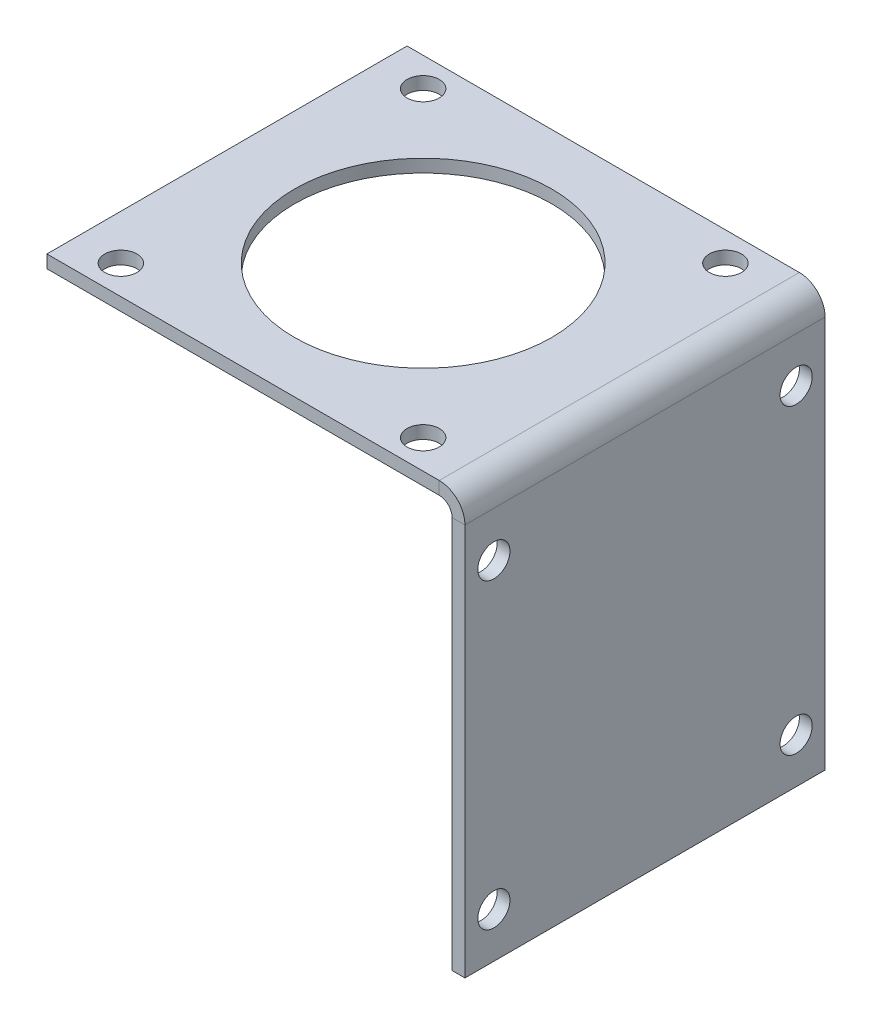
ISO-10303-21;
HEADER;
FILE_DESCRIPTION(('STEP AP214'),'2;1');
FILE_NAME('part.step','',(''),(''),'','','');
FILE_SCHEMA(('AUTOMOTIVE_DESIGN { 1 0 10303 214 1 1 1 1 }'));
ENDSEC;
DATA;
#1=APPLICATION_CONTEXT('core data for automotive mechanical design processes');
#2=APPLICATION_PROTOCOL_DEFINITION('international standard','automotive_design',2000,#1);
#3=PRODUCT_CONTEXT('',#1,'mechanical');
#4=PRODUCT('Part','Part','',(#3));
#5=PRODUCT_RELATED_PRODUCT_CATEGORY('part','',(#4));
#6=PRODUCT_DEFINITION_FORMATION('','',#4);
#7=PRODUCT_DEFINITION_CONTEXT('part definition',#1,'design');
#8=PRODUCT_DEFINITION('design','',#6,#7);
#9=PRODUCT_DEFINITION_SHAPE('','',#8);
#10=(LENGTH_UNIT() NAMED_UNIT(*) SI_UNIT(.MILLI.,.METRE.));
#11=(NAMED_UNIT(*) PLANE_ANGLE_UNIT() SI_UNIT($,.RADIAN.));
#12=(NAMED_UNIT(*) SI_UNIT($,.STERADIAN.) SOLID_ANGLE_UNIT());
#13=UNCERTAINTY_MEASURE_WITH_UNIT(LENGTH_MEASURE(1.E-05),#10,'distance_accuracy_value','');
#14=(GEOMETRIC_REPRESENTATION_CONTEXT(3) GLOBAL_UNCERTAINTY_ASSIGNED_CONTEXT((#13)) GLOBAL_UNIT_ASSIGNED_CONTEXT((#10,
#11,#12)) REPRESENTATION_CONTEXT('',''));
#15=CARTESIAN_POINT('',(0.,0.,0.));
#16=DIRECTION('',(0.,0.,1.));
#17=DIRECTION('',(1.,0.,0.));
#18=AXIS2_PLACEMENT_3D('',#15,#16,#17);
#19=CARTESIAN_POINT('',(0.,-4.,56.));
#20=DIRECTION('',(0.,0.,1.));
#21=DIRECTION('',(1.,0.,0.));
#22=AXIS2_PLACEMENT_3D('',#19,#20,#21);
#23=PLANE('',#22);
#24=DIRECTION('',(-1.,0.,0.));
#25=VECTOR('',#24,1.);
#26=CARTESIAN_POINT('',(0.,-4.,56.));
#27=LINE('',#26,#25);
#28=CARTESIAN_POINT('',(0.,-4.,56.));
#29=VERTEX_POINT('',#28);
#30=CARTESIAN_POINT('',(-2.,-4.,56.));
#31=VERTEX_POINT('',#30);
#32=EDGE_CURVE('E11',#29,#31,#27,.T.);
#33=ORIENTED_EDGE('',*,*,#32,.F.);
#34=CARTESIAN_POINT('',(-4.,-4.,56.));
#35=DIRECTION('',(0.,0.,1.));
#36=DIRECTION('',(1.,0.,0.));
#37=AXIS2_PLACEMENT_3D('',#34,#35,#36);
#38=CIRCLE('',#37,4.);
#39=CARTESIAN_POINT('',(-4.,0.,56.));
#40=VERTEX_POINT('',#39);
#41=EDGE_CURVE('E132',#40,#29,#38,.F.);
#42=ORIENTED_EDGE('',*,*,#41,.F.);
#43=DIRECTION('',(0.,1.,0.));
#44=VECTOR('',#43,1.);
#45=CARTESIAN_POINT('',(-4.,-2.,56.));
#46=LINE('',#45,#44);
#47=CARTESIAN_POINT('',(-4.,-2.,56.));
#48=VERTEX_POINT('',#47);
#49=EDGE_CURVE('E43',#48,#40,#46,.T.);
#50=ORIENTED_EDGE('',*,*,#49,.F.);
#51=CARTESIAN_POINT('',(-4.,-4.,56.));
#52=DIRECTION('',(0.,0.,1.));
#53=DIRECTION('',(1.,0.,0.));
#54=AXIS2_PLACEMENT_3D('',#51,#52,#53);
#55=CIRCLE('',#54,2.);
#56=EDGE_CURVE('E125',#48,#31,#55,.F.);
#57=ORIENTED_EDGE('',*,*,#56,.T.);
#58=EDGE_LOOP('',(#33,#42,#50,#57));
#59=FACE_BOUND('',#58,.T.);
#60=ADVANCED_FACE('F35',(#59),#23,.T.);
#61=CARTESIAN_POINT('',(-4.,-2.,56.));
#62=DIRECTION('',(0.,0.,1.));
#63=DIRECTION('',(1.,0.,0.));
#64=AXIS2_PLACEMENT_3D('',#61,#62,#63);
#65=PLANE('',#64);
#66=DIRECTION('',(0.,-1.,0.));
#67=VECTOR('',#66,1.);
#68=CARTESIAN_POINT('',(0.,0.,56.));
#69=LINE('',#68,#67);
#70=CARTESIAN_POINT('',(0.,-65.,56.));
#71=VERTEX_POINT('',#70);
#72=EDGE_CURVE('E182',#29,#71,#69,.T.);
#73=ORIENTED_EDGE('',*,*,#72,.F.);
#74=ORIENTED_EDGE('',*,*,#32,.T.);
#75=DIRECTION('',(0.,-1.,0.));
#76=VECTOR('',#75,1.);
#77=CARTESIAN_POINT('',(-2.,0.,56.));
#78=LINE('',#77,#76);
#79=CARTESIAN_POINT('',(-1.99999999999999,-65.,56.));
#80=VERTEX_POINT('',#79);
#81=EDGE_CURVE('E91',#31,#80,#78,.T.);
#82=ORIENTED_EDGE('',*,*,#81,.T.);
#83=DIRECTION('',(-1.,0.,0.));
#84=VECTOR('',#83,1.);
#85=CARTESIAN_POINT('',(0.,-65.,56.));
#86=LINE('',#85,#84);
#87=EDGE_CURVE('E498',#71,#80,#86,.T.);
#88=ORIENTED_EDGE('',*,*,#87,.F.);
#89=EDGE_LOOP('',(#73,#74,#82,#88));
#90=FACE_BOUND('',#89,.T.);
#91=ADVANCED_FACE('F190',(#90),#65,.T.);
#92=CARTESIAN_POINT('',(-4.,0.,0.));
#93=DIRECTION('',(0.,0.,-1.));
#94=DIRECTION('',(-1.,0.,0.));
#95=AXIS2_PLACEMENT_3D('',#92,#93,#94);
#96=PLANE('',#95);
#97=DIRECTION('',(0.,-1.,0.));
#98=VECTOR('',#97,1.);
#99=CARTESIAN_POINT('',(-4.,0.,0.));
#100=LINE('',#99,#98);
#101=CARTESIAN_POINT('',(-4.,0.,0.));
#102=VERTEX_POINT('',#101);
#103=CARTESIAN_POINT('',(-4.,-2.,0.));
#104=VERTEX_POINT('',#103);
#105=EDGE_CURVE('E78',#102,#104,#100,.T.);
#106=ORIENTED_EDGE('',*,*,#105,.F.);
#107=CARTESIAN_POINT('',(-4.,-4.,0.));
#108=DIRECTION('',(0.,0.,1.));
#109=DIRECTION('',(1.,0.,0.));
#110=AXIS2_PLACEMENT_3D('',#107,#108,#109);
#111=CIRCLE('',#110,4.);
#112=CARTESIAN_POINT('',(0.,-4.,0.));
#113=VERTEX_POINT('',#112);
#114=EDGE_CURVE('E148',#102,#113,#111,.F.);
#115=ORIENTED_EDGE('',*,*,#114,.T.);
#116=DIRECTION('',(1.,0.,0.));
#117=VECTOR('',#116,1.);
#118=CARTESIAN_POINT('',(-2.,-4.,0.));
#119=LINE('',#118,#117);
#120=CARTESIAN_POINT('',(-2.,-4.,0.));
#121=VERTEX_POINT('',#120);
#122=EDGE_CURVE('E85',#121,#113,#119,.T.);
#123=ORIENTED_EDGE('',*,*,#122,.F.);
#124=CARTESIAN_POINT('',(-4.,-4.,0.));
#125=DIRECTION('',(0.,0.,1.));
#126=DIRECTION('',(1.,0.,0.));
#127=AXIS2_PLACEMENT_3D('',#124,#125,#126);
#128=CIRCLE('',#127,2.);
#129=EDGE_CURVE('E155',#104,#121,#128,.F.);
#130=ORIENTED_EDGE('',*,*,#129,.F.);
#131=EDGE_LOOP('',(#106,#115,#123,#130));
#132=FACE_BOUND('',#131,.T.);
#133=ADVANCED_FACE('F188',(#132),#96,.T.);
#134=CARTESIAN_POINT('',(-2.,-4.,0.));
#135=DIRECTION('',(0.,0.,-1.));
#136=DIRECTION('',(-1.,0.,0.));
#137=AXIS2_PLACEMENT_3D('',#134,#135,#136);
#138=PLANE('',#137);
#139=DIRECTION('',(1.,0.,0.));
#140=VECTOR('',#139,1.);
#141=CARTESIAN_POINT('',(-65.,0.,0.));
#142=LINE('',#141,#140);
#143=CARTESIAN_POINT('',(-65.,0.,0.));
#144=VERTEX_POINT('',#143);
#145=EDGE_CURVE('E150',#144,#102,#142,.T.);
#146=ORIENTED_EDGE('',*,*,#145,.T.);
#147=ORIENTED_EDGE('',*,*,#105,.T.);
#148=DIRECTION('',(1.,0.,0.));
#149=VECTOR('',#148,1.);
#150=CARTESIAN_POINT('',(-65.,-2.,0.));
#151=LINE('',#150,#149);
#152=CARTESIAN_POINT('',(-65.,-2.,0.));
#153=VERTEX_POINT('',#152);
#154=EDGE_CURVE('E153',#153,#104,#151,.T.);
#155=ORIENTED_EDGE('',*,*,#154,.F.);
#156=DIRECTION('',(0.,1.,0.));
#157=VECTOR('',#156,1.);
#158=CARTESIAN_POINT('',(-65.,-2.,0.));
#159=LINE('',#158,#157);
#160=EDGE_CURVE('E113',#153,#144,#159,.T.);
#161=ORIENTED_EDGE('',*,*,#160,.T.);
#162=EDGE_LOOP('',(#146,#147,#155,#161));
#163=FACE_BOUND('',#162,.T.);
#164=ADVANCED_FACE('F184',(#163),#138,.T.);
#165=CARTESIAN_POINT('',(-2.,0.,56.));
#166=DIRECTION('',(1.,0.,0.));
#167=DIRECTION('',(0.,1.,0.));
#168=AXIS2_PLACEMENT_3D('',#165,#166,#167);
#169=PLANE('',#168);
#170=CARTESIAN_POINT('',(-2.,-11.,51.5));
#171=DIRECTION('',(1.,0.,0.));
#172=DIRECTION('',(0.,1.,0.));
#173=AXIS2_PLACEMENT_3D('',#170,#171,#172);
#174=CIRCLE('',#173,2.5);
#175=CARTESIAN_POINT('',(-2.,-8.5,51.5));
#176=VERTEX_POINT('',#175);
#177=EDGE_CURVE('E452',#176,#176,#174,.F.);
#178=ORIENTED_EDGE('',*,*,#177,.F.);
#179=EDGE_LOOP('',(#178));
#180=FACE_BOUND('',#179,.T.);
#181=CARTESIAN_POINT('',(-1.99999999999999,-58.,51.5));
#182=DIRECTION('',(1.,0.,0.));
#183=DIRECTION('',(0.,1.,0.));
#184=AXIS2_PLACEMENT_3D('',#181,#182,#183);
#185=CIRCLE('',#184,2.5);
#186=CARTESIAN_POINT('',(-1.99999999999999,-55.5,51.5));
#187=VERTEX_POINT('',#186);
#188=EDGE_CURVE('E456',#187,#187,#185,.F.);
#189=ORIENTED_EDGE('',*,*,#188,.F.);
#190=EDGE_LOOP('',(#189));
#191=FACE_BOUND('',#190,.T.);
#192=CARTESIAN_POINT('',(-1.99999999999999,-58.,4.5));
#193=DIRECTION('',(1.,0.,0.));
#194=DIRECTION('',(0.,1.,0.));
#195=AXIS2_PLACEMENT_3D('',#192,#193,#194);
#196=CIRCLE('',#195,2.5);
#197=CARTESIAN_POINT('',(-1.99999999999999,-55.5,4.5));
#198=VERTEX_POINT('',#197);
#199=EDGE_CURVE('E465',#198,#198,#196,.F.);
#200=ORIENTED_EDGE('',*,*,#199,.F.);
#201=EDGE_LOOP('',(#200));
#202=FACE_BOUND('',#201,.T.);
#203=CARTESIAN_POINT('',(-2.,-11.,4.5));
#204=DIRECTION('',(1.,0.,0.));
#205=DIRECTION('',(0.,1.,0.));
#206=AXIS2_PLACEMENT_3D('',#203,#204,#205);
#207=CIRCLE('',#206,2.5);
#208=CARTESIAN_POINT('',(-2.,-8.5,4.5));
#209=VERTEX_POINT('',#208);
#210=EDGE_CURVE('E464',#209,#209,#207,.F.);
#211=ORIENTED_EDGE('',*,*,#210,.F.);
#212=EDGE_LOOP('',(#211));
#213=FACE_BOUND('',#212,.T.);
#214=DIRECTION('',(0.,-1.,0.));
#215=VECTOR('',#214,1.);
#216=CARTESIAN_POINT('',(-2.,0.,0.));
#217=LINE('',#216,#215);
#218=CARTESIAN_POINT('',(-1.99999999999999,-65.,0.));
#219=VERTEX_POINT('',#218);
#220=EDGE_CURVE('E138',#121,#219,#217,.T.);
#221=ORIENTED_EDGE('',*,*,#220,.T.);
#222=DIRECTION('',(0.,0.,-1.));
#223=VECTOR('',#222,1.);
#224=CARTESIAN_POINT('',(-1.99999999999999,-65.,56.));
#225=LINE('',#224,#223);
#226=EDGE_CURVE('E169',#80,#219,#225,.T.);
#227=ORIENTED_EDGE('',*,*,#226,.F.);
#228=ORIENTED_EDGE('',*,*,#81,.F.);
#229=DIRECTION('',(0.,0.,-1.));
#230=VECTOR('',#229,1.);
#231=CARTESIAN_POINT('',(-2.,-4.,56.));
#232=LINE('',#231,#230);
#233=EDGE_CURVE('E137',#31,#121,#232,.T.);
#234=ORIENTED_EDGE('',*,*,#233,.T.);
#235=EDGE_LOOP('',(#221,#227,#228,#234));
#236=FACE_BOUND('',#235,.T.);
#237=ADVANCED_FACE('F196',(#180,#191,#202,#213,#236),#169,.F.);
#238=CARTESIAN_POINT('',(0.,-65.,56.));
#239=DIRECTION('',(0.,-1.,0.));
#240=DIRECTION('',(0.,0.,-1.));
#241=AXIS2_PLACEMENT_3D('',#238,#239,#240);
#242=PLANE('',#241);
#243=DIRECTION('',(-1.,0.,0.));
#244=VECTOR('',#243,1.);
#245=CARTESIAN_POINT('',(0.,-65.,0.));
#246=LINE('',#245,#244);
#247=CARTESIAN_POINT('',(0.,-65.,0.));
#248=VERTEX_POINT('',#247);
#249=EDGE_CURVE('E141',#248,#219,#246,.T.);
#250=ORIENTED_EDGE('',*,*,#249,.F.);
#251=DIRECTION('',(0.,0.,-1.));
#252=VECTOR('',#251,1.);
#253=CARTESIAN_POINT('',(0.,-65.,56.));
#254=LINE('',#253,#252);
#255=EDGE_CURVE('E167',#71,#248,#254,.T.);
#256=ORIENTED_EDGE('',*,*,#255,.F.);
#257=ORIENTED_EDGE('',*,*,#87,.T.);
#258=ORIENTED_EDGE('',*,*,#226,.T.);
#259=EDGE_LOOP('',(#250,#256,#257,#258));
#260=FACE_BOUND('',#259,.T.);
#261=ADVANCED_FACE('F225',(#260),#242,.T.);
#262=CARTESIAN_POINT('',(0.,0.,56.));
#263=DIRECTION('',(1.,0.,0.));
#264=DIRECTION('',(0.,1.,0.));
#265=AXIS2_PLACEMENT_3D('',#262,#263,#264);
#266=PLANE('',#265);
#267=CARTESIAN_POINT('',(0.,-11.,51.5));
#268=DIRECTION('',(1.,0.,0.));
#269=DIRECTION('',(0.,1.,0.));
#270=AXIS2_PLACEMENT_3D('',#267,#268,#269);
#271=CIRCLE('',#270,2.5);
#272=CARTESIAN_POINT('',(0.,-8.5,51.5));
#273=VERTEX_POINT('',#272);
#274=EDGE_CURVE('E449',#273,#273,#271,.T.);
#275=ORIENTED_EDGE('',*,*,#274,.F.);
#276=EDGE_LOOP('',(#275));
#277=FACE_BOUND('',#276,.T.);
#278=CARTESIAN_POINT('',(0.,-58.,51.5));
#279=DIRECTION('',(1.,0.,0.));
#280=DIRECTION('',(0.,1.,0.));
#281=AXIS2_PLACEMENT_3D('',#278,#279,#280);
#282=CIRCLE('',#281,2.5);
#283=CARTESIAN_POINT('',(0.,-55.5,51.5));
#284=VERTEX_POINT('',#283);
#285=EDGE_CURVE('E453',#284,#284,#282,.T.);
#286=ORIENTED_EDGE('',*,*,#285,.F.);
#287=EDGE_LOOP('',(#286));
#288=FACE_BOUND('',#287,.T.);
#289=CARTESIAN_POINT('',(0.,-58.,4.5));
#290=DIRECTION('',(1.,0.,0.));
#291=DIRECTION('',(0.,1.,0.));
#292=AXIS2_PLACEMENT_3D('',#289,#290,#291);
#293=CIRCLE('',#292,2.5);
#294=CARTESIAN_POINT('',(0.,-55.5,4.5));
#295=VERTEX_POINT('',#294);
#296=EDGE_CURVE('E535',#295,#295,#293,.T.);
#297=ORIENTED_EDGE('',*,*,#296,.F.);
#298=EDGE_LOOP('',(#297));
#299=FACE_BOUND('',#298,.T.);
#300=CARTESIAN_POINT('',(0.,-11.,4.5));
#301=DIRECTION('',(1.,0.,0.));
#302=DIRECTION('',(0.,1.,0.));
#303=AXIS2_PLACEMENT_3D('',#300,#301,#302);
#304=CIRCLE('',#303,2.5);
#305=CARTESIAN_POINT('',(0.,-8.5,4.5));
#306=VERTEX_POINT('',#305);
#307=EDGE_CURVE('E461',#306,#306,#304,.T.);
#308=ORIENTED_EDGE('',*,*,#307,.F.);
#309=EDGE_LOOP('',(#308));
#310=FACE_BOUND('',#309,.T.);
#311=DIRECTION('',(0.,-1.,0.));
#312=VECTOR('',#311,1.);
#313=CARTESIAN_POINT('',(0.,0.,0.));
#314=LINE('',#313,#312);
#315=EDGE_CURVE('E145',#113,#248,#314,.T.);
#316=ORIENTED_EDGE('',*,*,#315,.F.);
#317=DIRECTION('',(0.,0.,-1.));
#318=VECTOR('',#317,1.);
#319=CARTESIAN_POINT('',(0.,-4.,56.));
#320=LINE('',#319,#318);
#321=EDGE_CURVE('E164',#29,#113,#320,.T.);
#322=ORIENTED_EDGE('',*,*,#321,.F.);
#323=ORIENTED_EDGE('',*,*,#72,.T.);
#324=ORIENTED_EDGE('',*,*,#255,.T.);
#325=EDGE_LOOP('',(#316,#322,#323,#324));
#326=FACE_BOUND('',#325,.T.);
#327=ADVANCED_FACE('F230',(#277,#288,#299,#310,#326),#266,.T.);
#328=CARTESIAN_POINT('',(-4.,-4.,56.));
#329=DIRECTION('',(0.,0.,-1.));
#330=DIRECTION('',(-1.,0.,0.));
#331=AXIS2_PLACEMENT_3D('',#328,#329,#330);
#332=CYLINDRICAL_SURFACE('',#331,4.);
#333=ORIENTED_EDGE('',*,*,#114,.F.);
#334=DIRECTION('',(0.,0.,-1.));
#335=VECTOR('',#334,1.);
#336=CARTESIAN_POINT('',(-4.,0.,56.));
#337=LINE('',#336,#335);
#338=EDGE_CURVE('E161',#40,#102,#337,.T.);
#339=ORIENTED_EDGE('',*,*,#338,.F.);
#340=ORIENTED_EDGE('',*,*,#41,.T.);
#341=ORIENTED_EDGE('',*,*,#321,.T.);
#342=EDGE_LOOP('',(#333,#339,#340,#341));
#343=FACE_BOUND('',#342,.T.);
#344=ADVANCED_FACE('F178',(#343),#332,.T.);
#345=CARTESIAN_POINT('',(-65.,0.,56.));
#346=DIRECTION('',(0.,1.,0.));
#347=DIRECTION('',(0.,0.,1.));
#348=AXIS2_PLACEMENT_3D('',#345,#346,#347);
#349=PLANE('',#348);
#350=CARTESIAN_POINT('',(-58.,0.,51.5));
#351=DIRECTION('',(0.,1.,0.));
#352=DIRECTION('',(0.,0.,1.));
#353=AXIS2_PLACEMENT_3D('',#350,#351,#352);
#354=CIRCLE('',#353,2.5);
#355=CARTESIAN_POINT('',(-58.,0.,54.));
#356=VERTEX_POINT('',#355);
#357=EDGE_CURVE('E468',#356,#356,#354,.T.);
#358=ORIENTED_EDGE('',*,*,#357,.F.);
#359=EDGE_LOOP('',(#358));
#360=FACE_BOUND('',#359,.T.);
#361=CARTESIAN_POINT('',(-11.,0.,51.5));
#362=DIRECTION('',(0.,1.,0.));
#363=DIRECTION('',(0.,0.,1.));
#364=AXIS2_PLACEMENT_3D('',#361,#362,#363);
#365=CIRCLE('',#364,2.5);
#366=CARTESIAN_POINT('',(-11.,0.,54.));
#367=VERTEX_POINT('',#366);
#368=EDGE_CURVE('E483',#367,#367,#365,.T.);
#369=ORIENTED_EDGE('',*,*,#368,.F.);
#370=EDGE_LOOP('',(#369));
#371=FACE_BOUND('',#370,.T.);
#372=CARTESIAN_POINT('',(-11.,0.,4.49999999999998));
#373=DIRECTION('',(0.,1.,0.));
#374=DIRECTION('',(0.,0.,1.));
#375=AXIS2_PLACEMENT_3D('',#372,#373,#374);
#376=CIRCLE('',#375,2.5);
#377=CARTESIAN_POINT('',(-11.,0.,6.99999999999998));
#378=VERTEX_POINT('',#377);
#379=EDGE_CURVE('E477',#378,#378,#376,.T.);
#380=ORIENTED_EDGE('',*,*,#379,.F.);
#381=EDGE_LOOP('',(#380));
#382=FACE_BOUND('',#381,.T.);
#383=CARTESIAN_POINT('',(-58.,0.,4.5));
#384=DIRECTION('',(0.,1.,0.));
#385=DIRECTION('',(0.,0.,1.));
#386=AXIS2_PLACEMENT_3D('',#383,#384,#385);
#387=CIRCLE('',#386,2.5);
#388=CARTESIAN_POINT('',(-58.,0.,7.));
#389=VERTEX_POINT('',#388);
#390=EDGE_CURVE('E469',#389,#389,#387,.T.);
#391=ORIENTED_EDGE('',*,*,#390,.F.);
#392=EDGE_LOOP('',(#391));
#393=FACE_BOUND('',#392,.T.);
#394=CARTESIAN_POINT('',(-34.5,0.,28.));
#395=DIRECTION('',(0.,1.,0.));
#396=DIRECTION('',(0.,0.,1.));
#397=AXIS2_PLACEMENT_3D('',#394,#395,#396);
#398=CIRCLE('',#397,20.);
#399=CARTESIAN_POINT('',(-34.5,0.,48.));
#400=VERTEX_POINT('',#399);
#401=EDGE_CURVE('E476',#400,#400,#398,.T.);
#402=ORIENTED_EDGE('',*,*,#401,.F.);
#403=EDGE_LOOP('',(#402));
#404=FACE_BOUND('',#403,.T.);
#405=ORIENTED_EDGE('',*,*,#145,.F.);
#406=DIRECTION('',(0.,0.,-1.));
#407=VECTOR('',#406,1.);
#408=CARTESIAN_POINT('',(-65.,0.,56.));
#409=LINE('',#408,#407);
#410=CARTESIAN_POINT('',(-65.,0.,56.));
#411=VERTEX_POINT('',#410);
#412=EDGE_CURVE('E115',#411,#144,#409,.T.);
#413=ORIENTED_EDGE('',*,*,#412,.F.);
#414=DIRECTION('',(1.,0.,0.));
#415=VECTOR('',#414,1.);
#416=CARTESIAN_POINT('',(-65.,0.,56.));
#417=LINE('',#416,#415);
#418=EDGE_CURVE('E130',#411,#40,#417,.T.);
#419=ORIENTED_EDGE('',*,*,#418,.T.);
#420=ORIENTED_EDGE('',*,*,#338,.T.);
#421=EDGE_LOOP('',(#405,#413,#419,#420));
#422=FACE_BOUND('',#421,.T.);
#423=ADVANCED_FACE('F183',(#360,#371,#382,#393,#404,#422),#349,.T.);
#424=CARTESIAN_POINT('',(-65.,-2.,56.));
#425=DIRECTION('',(-1.,0.,0.));
#426=DIRECTION('',(0.,0.,1.));
#427=AXIS2_PLACEMENT_3D('',#424,#425,#426);
#428=PLANE('',#427);
#429=ORIENTED_EDGE('',*,*,#160,.F.);
#430=DIRECTION('',(0.,0.,-1.));
#431=VECTOR('',#430,1.);
#432=CARTESIAN_POINT('',(-65.,-2.,56.));
#433=LINE('',#432,#431);
#434=CARTESIAN_POINT('',(-65.,-2.,56.));
#435=VERTEX_POINT('',#434);
#436=EDGE_CURVE('E107',#435,#153,#433,.T.);
#437=ORIENTED_EDGE('',*,*,#436,.F.);
#438=DIRECTION('',(0.,1.,0.));
#439=VECTOR('',#438,1.);
#440=CARTESIAN_POINT('',(-65.,-2.,56.));
#441=LINE('',#440,#439);
#442=EDGE_CURVE('E111',#435,#411,#441,.T.);
#443=ORIENTED_EDGE('',*,*,#442,.T.);
#444=ORIENTED_EDGE('',*,*,#412,.T.);
#445=EDGE_LOOP('',(#429,#437,#443,#444));
#446=FACE_BOUND('',#445,.T.);
#447=ADVANCED_FACE('F109',(#446),#428,.T.);
#448=CARTESIAN_POINT('',(-65.,-2.,56.));
#449=DIRECTION('',(0.,1.,0.));
#450=DIRECTION('',(0.,0.,1.));
#451=AXIS2_PLACEMENT_3D('',#448,#449,#450);
#452=PLANE('',#451);
#453=CARTESIAN_POINT('',(-58.,-2.,51.5));
#454=DIRECTION('',(0.,1.,0.));
#455=DIRECTION('',(0.,0.,1.));
#456=AXIS2_PLACEMENT_3D('',#453,#454,#455);
#457=CIRCLE('',#456,2.5);
#458=CARTESIAN_POINT('',(-58.,-2.,54.));
#459=VERTEX_POINT('',#458);
#460=EDGE_CURVE('E486',#459,#459,#457,.F.);
#461=ORIENTED_EDGE('',*,*,#460,.F.);
#462=EDGE_LOOP('',(#461));
#463=FACE_BOUND('',#462,.T.);
#464=CARTESIAN_POINT('',(-11.,-2.,51.5));
#465=DIRECTION('',(0.,1.,0.));
#466=DIRECTION('',(0.,0.,1.));
#467=AXIS2_PLACEMENT_3D('',#464,#465,#466);
#468=CIRCLE('',#467,2.5);
#469=CARTESIAN_POINT('',(-11.,-2.,54.));
#470=VERTEX_POINT('',#469);
#471=EDGE_CURVE('E480',#470,#470,#468,.F.);
#472=ORIENTED_EDGE('',*,*,#471,.F.);
#473=EDGE_LOOP('',(#472));
#474=FACE_BOUND('',#473,.T.);
#475=CARTESIAN_POINT('',(-11.,-2.,4.49999999999998));
#476=DIRECTION('',(0.,1.,0.));
#477=DIRECTION('',(0.,0.,1.));
#478=AXIS2_PLACEMENT_3D('',#475,#476,#477);
#479=CIRCLE('',#478,2.5);
#480=CARTESIAN_POINT('',(-11.,-2.,6.99999999999998));
#481=VERTEX_POINT('',#480);
#482=EDGE_CURVE('E473',#481,#481,#479,.F.);
#483=ORIENTED_EDGE('',*,*,#482,.F.);
#484=EDGE_LOOP('',(#483));
#485=FACE_BOUND('',#484,.T.);
#486=CARTESIAN_POINT('',(-58.,-2.,4.5));
#487=DIRECTION('',(0.,1.,0.));
#488=DIRECTION('',(0.,0.,1.));
#489=AXIS2_PLACEMENT_3D('',#486,#487,#488);
#490=CIRCLE('',#489,2.5);
#491=CARTESIAN_POINT('',(-58.,-2.,7.));
#492=VERTEX_POINT('',#491);
#493=EDGE_CURVE('E472',#492,#492,#490,.F.);
#494=ORIENTED_EDGE('',*,*,#493,.F.);
#495=EDGE_LOOP('',(#494));
#496=FACE_BOUND('',#495,.T.);
#497=CARTESIAN_POINT('',(-34.5,-2.,28.));
#498=DIRECTION('',(0.,1.,0.));
#499=DIRECTION('',(0.,0.,1.));
#500=AXIS2_PLACEMENT_3D('',#497,#498,#499);
#501=CIRCLE('',#500,20.);
#502=CARTESIAN_POINT('',(-34.5,-2.,48.));
#503=VERTEX_POINT('',#502);
#504=EDGE_CURVE('E142',#503,#503,#501,.F.);
#505=ORIENTED_EDGE('',*,*,#504,.F.);
#506=EDGE_LOOP('',(#505));
#507=FACE_BOUND('',#506,.T.);
#508=ORIENTED_EDGE('',*,*,#154,.T.);
#509=DIRECTION('',(0.,0.,-1.));
#510=VECTOR('',#509,1.);
#511=CARTESIAN_POINT('',(-4.,-2.,56.));
#512=LINE('',#511,#510);
#513=EDGE_CURVE('E116',#48,#104,#512,.T.);
#514=ORIENTED_EDGE('',*,*,#513,.F.);
#515=DIRECTION('',(1.,0.,0.));
#516=VECTOR('',#515,1.);
#517=CARTESIAN_POINT('',(-65.,-2.,56.));
#518=LINE('',#517,#516);
#519=EDGE_CURVE('E120',#435,#48,#518,.T.);
#520=ORIENTED_EDGE('',*,*,#519,.F.);
#521=ORIENTED_EDGE('',*,*,#436,.T.);
#522=EDGE_LOOP('',(#508,#514,#520,#521));
#523=FACE_BOUND('',#522,.T.);
#524=ADVANCED_FACE('F121',(#463,#474,#485,#496,#507,#523),#452,.F.);
#525=CARTESIAN_POINT('',(-4.,-4.,56.));
#526=DIRECTION('',(0.,0.,-1.));
#527=DIRECTION('',(-1.,0.,0.));
#528=AXIS2_PLACEMENT_3D('',#525,#526,#527);
#529=CYLINDRICAL_SURFACE('',#528,2.);
#530=ORIENTED_EDGE('',*,*,#129,.T.);
#531=ORIENTED_EDGE('',*,*,#233,.F.);
#532=ORIENTED_EDGE('',*,*,#56,.F.);
#533=ORIENTED_EDGE('',*,*,#513,.T.);
#534=EDGE_LOOP('',(#530,#531,#532,#533));
#535=FACE_BOUND('',#534,.T.);
#536=ADVANCED_FACE('F186',(#535),#529,.F.);
#537=CARTESIAN_POINT('',(-4.,-4.,56.));
#538=DIRECTION('',(0.,0.,1.));
#539=DIRECTION('',(1.,0.,0.));
#540=AXIS2_PLACEMENT_3D('',#537,#538,#539);
#541=PLANE('',#540);
#542=ORIENTED_EDGE('',*,*,#519,.T.);
#543=ORIENTED_EDGE('',*,*,#49,.T.);
#544=ORIENTED_EDGE('',*,*,#418,.F.);
#545=ORIENTED_EDGE('',*,*,#442,.F.);
#546=EDGE_LOOP('',(#542,#543,#544,#545));
#547=FACE_BOUND('',#546,.T.);
#548=ADVANCED_FACE('F128',(#547),#541,.T.);
#549=CARTESIAN_POINT('',(-4.,-4.,0.));
#550=DIRECTION('',(0.,0.,1.));
#551=DIRECTION('',(1.,0.,0.));
#552=AXIS2_PLACEMENT_3D('',#549,#550,#551);
#553=PLANE('',#552);
#554=ORIENTED_EDGE('',*,*,#220,.F.);
#555=ORIENTED_EDGE('',*,*,#122,.T.);
#556=ORIENTED_EDGE('',*,*,#315,.T.);
#557=ORIENTED_EDGE('',*,*,#249,.T.);
#558=EDGE_LOOP('',(#554,#555,#556,#557));
#559=FACE_BOUND('',#558,.T.);
#560=ADVANCED_FACE('F274',(#559),#553,.F.);
#561=CARTESIAN_POINT('',(-34.5,-65.001,28.));
#562=DIRECTION('',(0.,1.,0.));
#563=DIRECTION('',(0.,0.,1.));
#564=AXIS2_PLACEMENT_3D('',#561,#562,#563);
#565=CYLINDRICAL_SURFACE('',#564,20.);
#566=ORIENTED_EDGE('',*,*,#401,.T.);
#567=EDGE_LOOP('',(#566));
#568=FACE_BOUND('',#567,.T.);
#569=ORIENTED_EDGE('',*,*,#504,.T.);
#570=EDGE_LOOP('',(#569));
#571=FACE_BOUND('',#570,.T.);
#572=ADVANCED_FACE('F284',(#568,#571),#565,.F.);
#573=CARTESIAN_POINT('',(-58.,-65.001,4.5));
#574=DIRECTION('',(0.,1.,0.));
#575=DIRECTION('',(0.,0.,1.));
#576=AXIS2_PLACEMENT_3D('',#573,#574,#575);
#577=CYLINDRICAL_SURFACE('',#576,2.5);
#578=ORIENTED_EDGE('',*,*,#390,.T.);
#579=EDGE_LOOP('',(#578));
#580=FACE_BOUND('',#579,.T.);
#581=ORIENTED_EDGE('',*,*,#493,.T.);
#582=EDGE_LOOP('',(#581));
#583=FACE_BOUND('',#582,.T.);
#584=ADVANCED_FACE('F311',(#580,#583),#577,.F.);
#585=CARTESIAN_POINT('',(-11.,-65.001,4.49999999999998));
#586=DIRECTION('',(0.,1.,0.));
#587=DIRECTION('',(0.,0.,1.));
#588=AXIS2_PLACEMENT_3D('',#585,#586,#587);
#589=CYLINDRICAL_SURFACE('',#588,2.5);
#590=ORIENTED_EDGE('',*,*,#379,.T.);
#591=EDGE_LOOP('',(#590));
#592=FACE_BOUND('',#591,.T.);
#593=ORIENTED_EDGE('',*,*,#482,.T.);
#594=EDGE_LOOP('',(#593));
#595=FACE_BOUND('',#594,.T.);
#596=ADVANCED_FACE('F322',(#592,#595),#589,.F.);
#597=CARTESIAN_POINT('',(-11.,-65.001,51.5));
#598=DIRECTION('',(0.,1.,0.));
#599=DIRECTION('',(0.,0.,1.));
#600=AXIS2_PLACEMENT_3D('',#597,#598,#599);
#601=CYLINDRICAL_SURFACE('',#600,2.5);
#602=ORIENTED_EDGE('',*,*,#368,.T.);
#603=EDGE_LOOP('',(#602));
#604=FACE_BOUND('',#603,.T.);
#605=ORIENTED_EDGE('',*,*,#471,.T.);
#606=EDGE_LOOP('',(#605));
#607=FACE_BOUND('',#606,.T.);
#608=ADVANCED_FACE('F333',(#604,#607),#601,.F.);
#609=CARTESIAN_POINT('',(-58.,-65.001,51.5));
#610=DIRECTION('',(0.,1.,0.));
#611=DIRECTION('',(0.,0.,1.));
#612=AXIS2_PLACEMENT_3D('',#609,#610,#611);
#613=CYLINDRICAL_SURFACE('',#612,2.5);
#614=ORIENTED_EDGE('',*,*,#357,.T.);
#615=EDGE_LOOP('',(#614));
#616=FACE_BOUND('',#615,.T.);
#617=ORIENTED_EDGE('',*,*,#460,.T.);
#618=EDGE_LOOP('',(#617));
#619=FACE_BOUND('',#618,.T.);
#620=ADVANCED_FACE('F344',(#616,#619),#613,.F.);
#621=CARTESIAN_POINT('',(-65.001,-11.,4.5));
#622=DIRECTION('',(1.,0.,0.));
#623=DIRECTION('',(0.,1.,0.));
#624=AXIS2_PLACEMENT_3D('',#621,#622,#623);
#625=CYLINDRICAL_SURFACE('',#624,2.5);
#626=ORIENTED_EDGE('',*,*,#307,.T.);
#627=EDGE_LOOP('',(#626));
#628=FACE_BOUND('',#627,.T.);
#629=ORIENTED_EDGE('',*,*,#210,.T.);
#630=EDGE_LOOP('',(#629));
#631=FACE_BOUND('',#630,.T.);
#632=ADVANCED_FACE('F355',(#628,#631),#625,.F.);
#633=CARTESIAN_POINT('',(-65.001,-58.,4.5));
#634=DIRECTION('',(1.,0.,0.));
#635=DIRECTION('',(0.,1.,0.));
#636=AXIS2_PLACEMENT_3D('',#633,#634,#635);
#637=CYLINDRICAL_SURFACE('',#636,2.5);
#638=ORIENTED_EDGE('',*,*,#296,.T.);
#639=EDGE_LOOP('',(#638));
#640=FACE_BOUND('',#639,.T.);
#641=ORIENTED_EDGE('',*,*,#199,.T.);
#642=EDGE_LOOP('',(#641));
#643=FACE_BOUND('',#642,.T.);
#644=ADVANCED_FACE('F382',(#640,#643),#637,.F.);
#645=CARTESIAN_POINT('',(-65.001,-58.,51.5));
#646=DIRECTION('',(1.,0.,0.));
#647=DIRECTION('',(0.,1.,0.));
#648=AXIS2_PLACEMENT_3D('',#645,#646,#647);
#649=CYLINDRICAL_SURFACE('',#648,2.5);
#650=ORIENTED_EDGE('',*,*,#285,.T.);
#651=EDGE_LOOP('',(#650));
#652=FACE_BOUND('',#651,.T.);
#653=ORIENTED_EDGE('',*,*,#188,.T.);
#654=EDGE_LOOP('',(#653));
#655=FACE_BOUND('',#654,.T.);
#656=ADVANCED_FACE('F393',(#652,#655),#649,.F.);
#657=CARTESIAN_POINT('',(-65.001,-11.,51.5));
#658=DIRECTION('',(1.,0.,0.));
#659=DIRECTION('',(0.,1.,0.));
#660=AXIS2_PLACEMENT_3D('',#657,#658,#659);
#661=CYLINDRICAL_SURFACE('',#660,2.5);
#662=ORIENTED_EDGE('',*,*,#274,.T.);
#663=EDGE_LOOP('',(#662));
#664=FACE_BOUND('',#663,.T.);
#665=ORIENTED_EDGE('',*,*,#177,.T.);
#666=EDGE_LOOP('',(#665));
#667=FACE_BOUND('',#666,.T.);
#668=ADVANCED_FACE('F404',(#664,#667),#661,.F.);
#669=CLOSED_SHELL('',(#60,#91,#133,#164,#237,#261,#327,#344,#423,#447,#524,#536,#548,#560,#572,
#584,#596,#608,#620,#632,#644,#656,#668));
#670=MANIFOLD_SOLID_BREP('B2',#669);
#671=ADVANCED_BREP_SHAPE_REPRESENTATION('',(#18,#670),#14);
#672=SHAPE_DEFINITION_REPRESENTATION(#9,#671);
ENDSEC;
END-ISO-10303-21;
